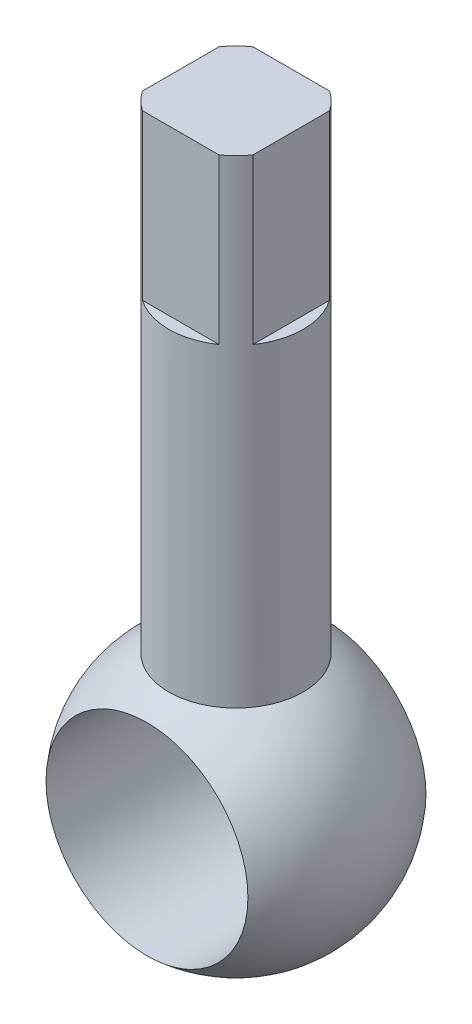
ISO-10303-21;
HEADER;
FILE_DESCRIPTION(('STEP AP214'),'2;1');
FILE_NAME('part.step','',(''),(''),'','','');
FILE_SCHEMA(('AUTOMOTIVE_DESIGN { 1 0 10303 214 1 1 1 1 }'));
ENDSEC;
DATA;
#1=APPLICATION_CONTEXT('core data for automotive mechanical design processes');
#2=APPLICATION_PROTOCOL_DEFINITION('international standard','automotive_design',2000,#1);
#3=PRODUCT_CONTEXT('',#1,'mechanical');
#4=PRODUCT('Part','Part','',(#3));
#5=PRODUCT_RELATED_PRODUCT_CATEGORY('part','',(#4));
#6=PRODUCT_DEFINITION_FORMATION('','',#4);
#7=PRODUCT_DEFINITION_CONTEXT('part definition',#1,'design');
#8=PRODUCT_DEFINITION('design','',#6,#7);
#9=PRODUCT_DEFINITION_SHAPE('','',#8);
#10=(LENGTH_UNIT() NAMED_UNIT(*) SI_UNIT(.MILLI.,.METRE.));
#11=(NAMED_UNIT(*) PLANE_ANGLE_UNIT() SI_UNIT($,.RADIAN.));
#12=(NAMED_UNIT(*) SI_UNIT($,.STERADIAN.) SOLID_ANGLE_UNIT());
#13=UNCERTAINTY_MEASURE_WITH_UNIT(LENGTH_MEASURE(1.E-05),#10,'distance_accuracy_value','');
#14=(GEOMETRIC_REPRESENTATION_CONTEXT(3) GLOBAL_UNCERTAINTY_ASSIGNED_CONTEXT((#13)) GLOBAL_UNIT_ASSIGNED_CONTEXT((#10,
#11,#12)) REPRESENTATION_CONTEXT('',''));
#15=CARTESIAN_POINT('',(0.,0.,0.));
#16=DIRECTION('',(0.,0.,1.));
#17=DIRECTION('',(1.,0.,0.));
#18=AXIS2_PLACEMENT_3D('',#15,#16,#17);
#19=CARTESIAN_POINT('',(0.,25.4,0.));
#20=DIRECTION('',(0.,-1.,0.));
#21=DIRECTION('',(-1.,0.,0.));
#22=AXIS2_PLACEMENT_3D('',#19,#20,#21);
#23=SPHERICAL_SURFACE('',#22,25.4);
#24=CARTESIAN_POINT('',(0.,25.4,16.8005208252601));
#25=DIRECTION('',(0.,0.,-1.));
#26=DIRECTION('',(-1.,0.,0.));
#27=AXIS2_PLACEMENT_3D('',#24,#25,#26);
#28=CIRCLE('',#27,19.05);
#29=CARTESIAN_POINT('',(-19.05,25.4,16.8005208252601));
#30=VERTEX_POINT('',#29);
#31=EDGE_CURVE('E146',#30,#30,#28,.T.);
#32=ORIENTED_EDGE('',*,*,#31,.T.);
#33=EDGE_LOOP('',(#32));
#34=FACE_BOUND('',#33,.T.);
#35=CARTESIAN_POINT('',(0.,25.4,-16.8005208252601));
#36=DIRECTION('',(0.,0.,1.));
#37=DIRECTION('',(1.,0.,0.));
#38=AXIS2_PLACEMENT_3D('',#35,#36,#37);
#39=CIRCLE('',#38,19.05);
#40=CARTESIAN_POINT('',(19.05,25.4,-16.8005208252601));
#41=VERTEX_POINT('',#40);
#42=EDGE_CURVE('E139',#41,#41,#39,.T.);
#43=ORIENTED_EDGE('',*,*,#42,.T.);
#44=EDGE_LOOP('',(#43));
#45=FACE_BOUND('',#44,.T.);
#46=CARTESIAN_POINT('',(0.,47.3970452561247,0.));
#47=DIRECTION('',(0.,-1.,0.));
#48=DIRECTION('',(0.,0.,-1.));
#49=AXIS2_PLACEMENT_3D('',#46,#47,#48);
#50=CIRCLE('',#49,12.7);
#51=CARTESIAN_POINT('',(0.,47.3970452561247,-12.7));
#52=VERTEX_POINT('',#51);
#53=EDGE_CURVE('E142',#52,#52,#50,.T.);
#54=ORIENTED_EDGE('',*,*,#53,.T.);
#55=EDGE_LOOP('',(#54));
#56=FACE_BOUND('',#55,.T.);
#57=ADVANCED_FACE('F33',(#34,#45,#56),#23,.T.);
#58=CARTESIAN_POINT('',(0.,137.668,0.));
#59=DIRECTION('',(0.,-1.,0.));
#60=DIRECTION('',(0.,0.,-1.));
#61=AXIS2_PLACEMENT_3D('',#58,#59,#60);
#62=PLANE('',#61);
#63=CARTESIAN_POINT('',(0.,137.668,0.));
#64=DIRECTION('',(0.,-1.,0.));
#65=DIRECTION('',(0.,0.,-1.));
#66=AXIS2_PLACEMENT_3D('',#63,#64,#65);
#67=CIRCLE('',#66,12.7);
#68=CARTESIAN_POINT('',(-10.4348875892363,137.668,-7.23900000000011));
#69=VERTEX_POINT('',#68);
#70=CARTESIAN_POINT('',(-7.239,137.668,-10.4348875892364));
#71=VERTEX_POINT('',#70);
#72=EDGE_CURVE('E145',#69,#71,#67,.T.);
#73=ORIENTED_EDGE('',*,*,#72,.F.);
#74=DIRECTION('',(0.,0.,-1.));
#75=VECTOR('',#74,1.);
#76=CARTESIAN_POINT('',(-10.4348875892365,137.668,7.23899999999989));
#77=LINE('',#76,#75);
#78=CARTESIAN_POINT('',(-10.4348875892365,137.668,7.23899999999989));
#79=VERTEX_POINT('',#78);
#80=EDGE_CURVE('E103',#79,#69,#77,.T.);
#81=ORIENTED_EDGE('',*,*,#80,.F.);
#82=CARTESIAN_POINT('',(-7.239,137.668,10.4348875892364));
#83=VERTEX_POINT('',#82);
#84=EDGE_CURVE('E110',#83,#79,#67,.T.);
#85=ORIENTED_EDGE('',*,*,#84,.F.);
#86=DIRECTION('',(-1.,0.,0.));
#87=VECTOR('',#86,1.);
#88=CARTESIAN_POINT('',(7.239,137.668,10.4348875892364));
#89=LINE('',#88,#87);
#90=CARTESIAN_POINT('',(7.239,137.668,10.4348875892364));
#91=VERTEX_POINT('',#90);
#92=EDGE_CURVE('E112',#91,#83,#89,.T.);
#93=ORIENTED_EDGE('',*,*,#92,.F.);
#94=CARTESIAN_POINT('',(10.4348875892364,137.668,7.23900000000004));
#95=VERTEX_POINT('',#94);
#96=EDGE_CURVE('E151',#95,#91,#67,.T.);
#97=ORIENTED_EDGE('',*,*,#96,.F.);
#98=DIRECTION('',(0.,0.,1.));
#99=VECTOR('',#98,1.);
#100=CARTESIAN_POINT('',(10.4348875892364,137.668,-7.23899999999996));
#101=LINE('',#100,#99);
#102=CARTESIAN_POINT('',(10.4348875892364,137.668,-7.23899999999996));
#103=VERTEX_POINT('',#102);
#104=EDGE_CURVE('E121',#103,#95,#101,.T.);
#105=ORIENTED_EDGE('',*,*,#104,.F.);
#106=CARTESIAN_POINT('',(7.239,137.668,-10.4348875892364));
#107=VERTEX_POINT('',#106);
#108=EDGE_CURVE('E147',#107,#103,#67,.T.);
#109=ORIENTED_EDGE('',*,*,#108,.F.);
#110=DIRECTION('',(1.,0.,0.));
#111=VECTOR('',#110,1.);
#112=CARTESIAN_POINT('',(-7.239,137.668,-10.4348875892364));
#113=LINE('',#112,#111);
#114=EDGE_CURVE('E130',#71,#107,#113,.T.);
#115=ORIENTED_EDGE('',*,*,#114,.F.);
#116=EDGE_LOOP('',(#73,#81,#85,#93,#97,#105,#109,#115));
#117=FACE_BOUND('',#116,.T.);
#118=ADVANCED_FACE('F170',(#117),#62,.F.);
#119=CARTESIAN_POINT('',(0.,0.,0.));
#120=DIRECTION('',(0.,-1.,0.));
#121=DIRECTION('',(0.,0.,-1.));
#122=AXIS2_PLACEMENT_3D('',#119,#120,#121);
#123=CYLINDRICAL_SURFACE('',#122,12.7);
#124=ORIENTED_EDGE('',*,*,#84,.T.);
#125=DIRECTION('',(0.,1.,0.));
#126=VECTOR('',#125,1.);
#127=CARTESIAN_POINT('',(-10.4348875892365,106.68,7.23899999999989));
#128=LINE('',#127,#126);
#129=CARTESIAN_POINT('',(-10.4348875892365,106.68,7.23899999999989));
#130=VERTEX_POINT('',#129);
#131=EDGE_CURVE('E100',#130,#79,#128,.T.);
#132=ORIENTED_EDGE('',*,*,#131,.F.);
#133=CARTESIAN_POINT('',(0.,106.68,0.));
#134=DIRECTION('',(0.,-1.,0.));
#135=DIRECTION('',(0.,0.,-1.));
#136=AXIS2_PLACEMENT_3D('',#133,#134,#135);
#137=CIRCLE('',#136,12.7);
#138=CARTESIAN_POINT('',(-10.4348875892363,106.68,-7.23900000000011));
#139=VERTEX_POINT('',#138);
#140=EDGE_CURVE('E11',#130,#139,#137,.T.);
#141=ORIENTED_EDGE('',*,*,#140,.T.);
#142=DIRECTION('',(0.,1.,0.));
#143=VECTOR('',#142,1.);
#144=CARTESIAN_POINT('',(-10.4348875892363,106.68,-7.23900000000011));
#145=LINE('',#144,#143);
#146=EDGE_CURVE('E102',#139,#69,#145,.T.);
#147=ORIENTED_EDGE('',*,*,#146,.T.);
#148=ORIENTED_EDGE('',*,*,#72,.T.);
#149=DIRECTION('',(0.,1.,0.));
#150=VECTOR('',#149,1.);
#151=CARTESIAN_POINT('',(-7.239,106.68,-10.4348875892364));
#152=LINE('',#151,#150);
#153=CARTESIAN_POINT('',(-7.239,106.68,-10.4348875892364));
#154=VERTEX_POINT('',#153);
#155=EDGE_CURVE('E134',#154,#71,#152,.T.);
#156=ORIENTED_EDGE('',*,*,#155,.F.);
#157=CARTESIAN_POINT('',(0.,106.68,0.));
#158=DIRECTION('',(0.,-1.,0.));
#159=DIRECTION('',(0.,0.,-1.));
#160=AXIS2_PLACEMENT_3D('',#157,#158,#159);
#161=CIRCLE('',#160,12.7);
#162=CARTESIAN_POINT('',(7.239,106.68,-10.4348875892364));
#163=VERTEX_POINT('',#162);
#164=EDGE_CURVE('E150',#154,#163,#161,.T.);
#165=ORIENTED_EDGE('',*,*,#164,.T.);
#166=DIRECTION('',(0.,1.,0.));
#167=VECTOR('',#166,1.);
#168=CARTESIAN_POINT('',(7.239,106.68,-10.4348875892364));
#169=LINE('',#168,#167);
#170=EDGE_CURVE('E136',#163,#107,#169,.T.);
#171=ORIENTED_EDGE('',*,*,#170,.T.);
#172=ORIENTED_EDGE('',*,*,#108,.T.);
#173=DIRECTION('',(0.,1.,0.));
#174=VECTOR('',#173,1.);
#175=CARTESIAN_POINT('',(10.4348875892364,106.68,-7.23899999999996));
#176=LINE('',#175,#174);
#177=CARTESIAN_POINT('',(10.4348875892364,106.68,-7.23899999999996));
#178=VERTEX_POINT('',#177);
#179=EDGE_CURVE('E125',#178,#103,#176,.T.);
#180=ORIENTED_EDGE('',*,*,#179,.F.);
#181=CARTESIAN_POINT('',(0.,106.68,0.));
#182=DIRECTION('',(0.,-1.,0.));
#183=DIRECTION('',(0.,0.,-1.));
#184=AXIS2_PLACEMENT_3D('',#181,#182,#183);
#185=CIRCLE('',#184,12.7);
#186=CARTESIAN_POINT('',(10.4348875892364,106.68,7.23900000000004));
#187=VERTEX_POINT('',#186);
#188=EDGE_CURVE('E158',#178,#187,#185,.T.);
#189=ORIENTED_EDGE('',*,*,#188,.T.);
#190=DIRECTION('',(0.,1.,0.));
#191=VECTOR('',#190,1.);
#192=CARTESIAN_POINT('',(10.4348875892364,106.68,7.23900000000004));
#193=LINE('',#192,#191);
#194=EDGE_CURVE('E127',#187,#95,#193,.T.);
#195=ORIENTED_EDGE('',*,*,#194,.T.);
#196=ORIENTED_EDGE('',*,*,#96,.T.);
#197=DIRECTION('',(0.,1.,0.));
#198=VECTOR('',#197,1.);
#199=CARTESIAN_POINT('',(7.239,106.68,10.4348875892364));
#200=LINE('',#199,#198);
#201=CARTESIAN_POINT('',(7.239,106.68,10.4348875892364));
#202=VERTEX_POINT('',#201);
#203=EDGE_CURVE('E117',#202,#91,#200,.T.);
#204=ORIENTED_EDGE('',*,*,#203,.F.);
#205=CARTESIAN_POINT('',(0.,106.68,0.));
#206=DIRECTION('',(0.,-1.,0.));
#207=DIRECTION('',(0.,0.,-1.));
#208=AXIS2_PLACEMENT_3D('',#205,#206,#207);
#209=CIRCLE('',#208,12.7);
#210=CARTESIAN_POINT('',(-7.239,106.68,10.4348875892364));
#211=VERTEX_POINT('',#210);
#212=EDGE_CURVE('E40',#202,#211,#209,.T.);
#213=ORIENTED_EDGE('',*,*,#212,.T.);
#214=DIRECTION('',(0.,1.,0.));
#215=VECTOR('',#214,1.);
#216=CARTESIAN_POINT('',(-7.239,106.68,10.4348875892364));
#217=LINE('',#216,#215);
#218=EDGE_CURVE('E119',#211,#83,#217,.T.);
#219=ORIENTED_EDGE('',*,*,#218,.T.);
#220=EDGE_LOOP('',(#124,#132,#141,#147,#148,#156,#165,#171,#172,#180,#189,#195,#196,#204,#213,#219));
#221=FACE_BOUND('',#220,.T.);
#222=ORIENTED_EDGE('',*,*,#53,.F.);
#223=EDGE_LOOP('',(#222));
#224=FACE_BOUND('',#223,.T.);
#225=ADVANCED_FACE('F106',(#221,#224),#123,.T.);
#226=CARTESIAN_POINT('',(0.,25.4,-25.4));
#227=DIRECTION('',(0.,0.,1.));
#228=DIRECTION('',(1.,0.,0.));
#229=AXIS2_PLACEMENT_3D('',#226,#227,#228);
#230=CYLINDRICAL_SURFACE('',#229,19.05);
#231=ORIENTED_EDGE('',*,*,#42,.F.);
#232=EDGE_LOOP('',(#231));
#233=FACE_BOUND('',#232,.T.);
#234=ORIENTED_EDGE('',*,*,#31,.F.);
#235=EDGE_LOOP('',(#234));
#236=FACE_BOUND('',#235,.T.);
#237=ADVANCED_FACE('F184',(#233,#236),#230,.F.);
#238=CARTESIAN_POINT('',(0.,106.68,0.));
#239=DIRECTION('',(0.,-1.,0.));
#240=DIRECTION('',(0.,0.,-1.));
#241=AXIS2_PLACEMENT_3D('',#238,#239,#240);
#242=PLANE('',#241);
#243=DIRECTION('',(1.,0.,0.));
#244=VECTOR('',#243,1.);
#245=CARTESIAN_POINT('',(-7.239,106.68,-10.4348875892364));
#246=LINE('',#245,#244);
#247=EDGE_CURVE('E132',#154,#163,#246,.T.);
#248=ORIENTED_EDGE('',*,*,#247,.T.);
#249=ORIENTED_EDGE('',*,*,#164,.F.);
#250=EDGE_LOOP('',(#248,#249));
#251=FACE_BOUND('',#250,.T.);
#252=ADVANCED_FACE('F182',(#251),#242,.F.);
#253=CARTESIAN_POINT('',(-7.239,106.68,-10.4348875892364));
#254=DIRECTION('',(0.,0.,1.));
#255=DIRECTION('',(1.,0.,0.));
#256=AXIS2_PLACEMENT_3D('',#253,#254,#255);
#257=PLANE('',#256);
#258=ORIENTED_EDGE('',*,*,#114,.T.);
#259=ORIENTED_EDGE('',*,*,#170,.F.);
#260=ORIENTED_EDGE('',*,*,#247,.F.);
#261=ORIENTED_EDGE('',*,*,#155,.T.);
#262=EDGE_LOOP('',(#258,#259,#260,#261));
#263=FACE_BOUND('',#262,.T.);
#264=ADVANCED_FACE('F177',(#263),#257,.F.);
#265=CARTESIAN_POINT('',(0.,106.68,0.));
#266=DIRECTION('',(0.,-1.,0.));
#267=DIRECTION('',(1.,0.,0.));
#268=AXIS2_PLACEMENT_3D('',#265,#266,#267);
#269=PLANE('',#268);
#270=DIRECTION('',(0.,0.,1.));
#271=VECTOR('',#270,1.);
#272=CARTESIAN_POINT('',(10.4348875892364,106.68,-7.23899999999996));
#273=LINE('',#272,#271);
#274=EDGE_CURVE('E123',#178,#187,#273,.T.);
#275=ORIENTED_EDGE('',*,*,#274,.T.);
#276=ORIENTED_EDGE('',*,*,#188,.F.);
#277=EDGE_LOOP('',(#275,#276));
#278=FACE_BOUND('',#277,.T.);
#279=ADVANCED_FACE('F190',(#278),#269,.F.);
#280=CARTESIAN_POINT('',(10.4348875892364,106.68,-7.23899999999996));
#281=DIRECTION('',(-1.,0.,0.));
#282=DIRECTION('',(0.,0.,1.));
#283=AXIS2_PLACEMENT_3D('',#280,#281,#282);
#284=PLANE('',#283);
#285=ORIENTED_EDGE('',*,*,#104,.T.);
#286=ORIENTED_EDGE('',*,*,#194,.F.);
#287=ORIENTED_EDGE('',*,*,#274,.F.);
#288=ORIENTED_EDGE('',*,*,#179,.T.);
#289=EDGE_LOOP('',(#285,#286,#287,#288));
#290=FACE_BOUND('',#289,.T.);
#291=ADVANCED_FACE('F244',(#290),#284,.F.);
#292=CARTESIAN_POINT('',(0.,106.68,0.));
#293=DIRECTION('',(0.,-1.,0.));
#294=DIRECTION('',(0.,0.,1.));
#295=AXIS2_PLACEMENT_3D('',#292,#293,#294);
#296=PLANE('',#295);
#297=DIRECTION('',(-1.,0.,0.));
#298=VECTOR('',#297,1.);
#299=CARTESIAN_POINT('',(7.239,106.68,10.4348875892364));
#300=LINE('',#299,#298);
#301=EDGE_CURVE('E53',#202,#211,#300,.T.);
#302=ORIENTED_EDGE('',*,*,#301,.T.);
#303=ORIENTED_EDGE('',*,*,#212,.F.);
#304=EDGE_LOOP('',(#302,#303));
#305=FACE_BOUND('',#304,.T.);
#306=ADVANCED_FACE('F163',(#305),#296,.F.);
#307=CARTESIAN_POINT('',(7.239,106.68,10.4348875892364));
#308=DIRECTION('',(0.,0.,-1.));
#309=DIRECTION('',(-1.,0.,0.));
#310=AXIS2_PLACEMENT_3D('',#307,#308,#309);
#311=PLANE('',#310);
#312=ORIENTED_EDGE('',*,*,#92,.T.);
#313=ORIENTED_EDGE('',*,*,#218,.F.);
#314=ORIENTED_EDGE('',*,*,#301,.F.);
#315=ORIENTED_EDGE('',*,*,#203,.T.);
#316=EDGE_LOOP('',(#312,#313,#314,#315));
#317=FACE_BOUND('',#316,.T.);
#318=ADVANCED_FACE('F165',(#317),#311,.F.);
#319=CARTESIAN_POINT('',(0.,106.68,0.));
#320=DIRECTION('',(0.,-1.,0.));
#321=DIRECTION('',(-1.,0.,0.));
#322=AXIS2_PLACEMENT_3D('',#319,#320,#321);
#323=PLANE('',#322);
#324=DIRECTION('',(0.,0.,-1.));
#325=VECTOR('',#324,1.);
#326=CARTESIAN_POINT('',(-10.4348875892365,106.68,7.23899999999989));
#327=LINE('',#326,#325);
#328=EDGE_CURVE('E46',#130,#139,#327,.T.);
#329=ORIENTED_EDGE('',*,*,#328,.T.);
#330=ORIENTED_EDGE('',*,*,#140,.F.);
#331=EDGE_LOOP('',(#329,#330));
#332=FACE_BOUND('',#331,.T.);
#333=ADVANCED_FACE('F94',(#332),#323,.F.);
#334=CARTESIAN_POINT('',(-10.4348875892365,106.68,7.23899999999989));
#335=DIRECTION('',(1.,0.,0.));
#336=DIRECTION('',(0.,0.,-1.));
#337=AXIS2_PLACEMENT_3D('',#334,#335,#336);
#338=PLANE('',#337);
#339=ORIENTED_EDGE('',*,*,#80,.T.);
#340=ORIENTED_EDGE('',*,*,#146,.F.);
#341=ORIENTED_EDGE('',*,*,#328,.F.);
#342=ORIENTED_EDGE('',*,*,#131,.T.);
#343=EDGE_LOOP('',(#339,#340,#341,#342));
#344=FACE_BOUND('',#343,.T.);
#345=ADVANCED_FACE('F99',(#344),#338,.F.);
#346=CLOSED_SHELL('',(#57,#118,#225,#237,#252,#264,#279,#291,#306,#318,#333,#345));
#347=MANIFOLD_SOLID_BREP('B2',#346);
#348=ADVANCED_BREP_SHAPE_REPRESENTATION('',(#18,#347),#14);
#349=SHAPE_DEFINITION_REPRESENTATION(#9,#348);
ENDSEC;
END-ISO-10303-21;
